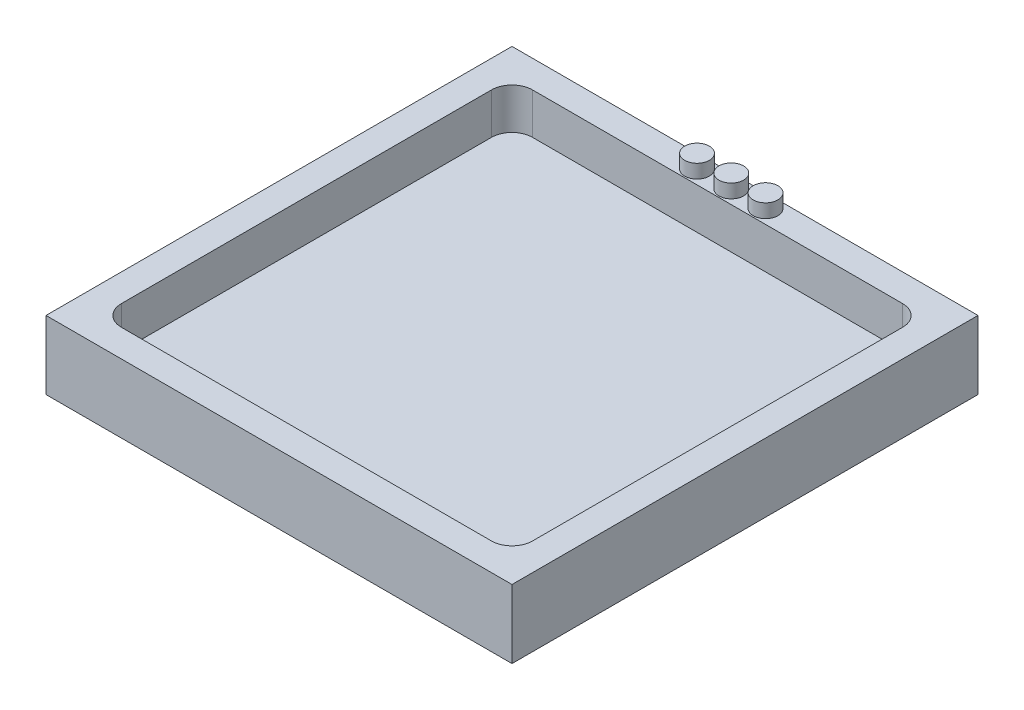
ISO-10303-21;
HEADER;
FILE_DESCRIPTION(('STEP AP214'),'2;1');
FILE_NAME('part.step','',(''),(''),'','','');
FILE_SCHEMA(('AUTOMOTIVE_DESIGN { 1 0 10303 214 1 1 1 1 }'));
ENDSEC;
DATA;
#1=APPLICATION_CONTEXT('core data for automotive mechanical design processes');
#2=APPLICATION_PROTOCOL_DEFINITION('international standard','automotive_design',2000,#1);
#3=PRODUCT_CONTEXT('',#1,'mechanical');
#4=PRODUCT('Part','Part','',(#3));
#5=PRODUCT_RELATED_PRODUCT_CATEGORY('part','',(#4));
#6=PRODUCT_DEFINITION_FORMATION('','',#4);
#7=PRODUCT_DEFINITION_CONTEXT('part definition',#1,'design');
#8=PRODUCT_DEFINITION('design','',#6,#7);
#9=PRODUCT_DEFINITION_SHAPE('','',#8);
#10=(LENGTH_UNIT() NAMED_UNIT(*) SI_UNIT(.MILLI.,.METRE.));
#11=(NAMED_UNIT(*) PLANE_ANGLE_UNIT() SI_UNIT($,.RADIAN.));
#12=(NAMED_UNIT(*) SI_UNIT($,.STERADIAN.) SOLID_ANGLE_UNIT());
#13=UNCERTAINTY_MEASURE_WITH_UNIT(LENGTH_MEASURE(1.E-05),#10,'distance_accuracy_value','');
#14=(GEOMETRIC_REPRESENTATION_CONTEXT(3) GLOBAL_UNCERTAINTY_ASSIGNED_CONTEXT((#13)) GLOBAL_UNIT_ASSIGNED_CONTEXT((#10,
#11,#12)) REPRESENTATION_CONTEXT('',''));
#15=CARTESIAN_POINT('',(0.,0.,0.));
#16=DIRECTION('',(0.,0.,1.));
#17=DIRECTION('',(1.,0.,0.));
#18=AXIS2_PLACEMENT_3D('',#15,#16,#17);
#19=CARTESIAN_POINT('',(0.,2.,0.));
#20=DIRECTION('',(0.,-1.,0.));
#21=DIRECTION('',(0.,0.,-1.));
#22=AXIS2_PLACEMENT_3D('',#19,#20,#21);
#23=PLANE('',#22);
#24=DIRECTION('',(1.,0.,0.));
#25=VECTOR('',#24,1.);
#26=CARTESIAN_POINT('',(-15.,2.,15.));
#27=LINE('',#26,#25);
#28=CARTESIAN_POINT('',(-13.5,2.,15.));
#29=VERTEX_POINT('',#28);
#30=CARTESIAN_POINT('',(13.5,2.,15.));
#31=VERTEX_POINT('',#30);
#32=EDGE_CURVE('E168',#29,#31,#27,.T.);
#33=ORIENTED_EDGE('',*,*,#32,.T.);
#34=CARTESIAN_POINT('',(13.5,2.,13.5));
#35=DIRECTION('',(0.,-1.,0.));
#36=DIRECTION('',(0.,0.,-1.));
#37=AXIS2_PLACEMENT_3D('',#34,#35,#36);
#38=CIRCLE('',#37,1.5);
#39=CARTESIAN_POINT('',(15.,2.,13.5));
#40=VERTEX_POINT('',#39);
#41=EDGE_CURVE('E182',#31,#40,#38,.F.);
#42=ORIENTED_EDGE('',*,*,#41,.T.);
#43=DIRECTION('',(0.,0.,-1.));
#44=VECTOR('',#43,1.);
#45=CARTESIAN_POINT('',(15.,2.,15.));
#46=LINE('',#45,#44);
#47=CARTESIAN_POINT('',(15.,2.,-13.5));
#48=VERTEX_POINT('',#47);
#49=EDGE_CURVE('E165',#40,#48,#46,.T.);
#50=ORIENTED_EDGE('',*,*,#49,.T.);
#51=CARTESIAN_POINT('',(13.5,2.,-13.5));
#52=DIRECTION('',(0.,-1.,0.));
#53=DIRECTION('',(0.,0.,-1.));
#54=AXIS2_PLACEMENT_3D('',#51,#52,#53);
#55=CIRCLE('',#54,1.5);
#56=CARTESIAN_POINT('',(13.5,2.,-15.));
#57=VERTEX_POINT('',#56);
#58=EDGE_CURVE('E176',#48,#57,#55,.F.);
#59=ORIENTED_EDGE('',*,*,#58,.T.);
#60=DIRECTION('',(1.,0.,0.));
#61=VECTOR('',#60,1.);
#62=CARTESIAN_POINT('',(-15.,2.,-15.));
#63=LINE('',#62,#61);
#64=CARTESIAN_POINT('',(-13.5,2.,-15.));
#65=VERTEX_POINT('',#64);
#66=EDGE_CURVE('E157',#65,#57,#63,.T.);
#67=ORIENTED_EDGE('',*,*,#66,.F.);
#68=CARTESIAN_POINT('',(-13.5,2.,-13.5));
#69=DIRECTION('',(0.,-1.,0.));
#70=DIRECTION('',(0.,0.,-1.));
#71=AXIS2_PLACEMENT_3D('',#68,#69,#70);
#72=CIRCLE('',#71,1.5);
#73=CARTESIAN_POINT('',(-15.,2.,-13.5));
#74=VERTEX_POINT('',#73);
#75=EDGE_CURVE('E180',#65,#74,#72,.F.);
#76=ORIENTED_EDGE('',*,*,#75,.T.);
#77=DIRECTION('',(0.,0.,-1.));
#78=VECTOR('',#77,1.);
#79=CARTESIAN_POINT('',(-15.,2.,15.));
#80=LINE('',#79,#78);
#81=CARTESIAN_POINT('',(-15.,2.,13.5));
#82=VERTEX_POINT('',#81);
#83=EDGE_CURVE('E155',#82,#74,#80,.T.);
#84=ORIENTED_EDGE('',*,*,#83,.F.);
#85=CARTESIAN_POINT('',(-13.5,2.,13.5));
#86=DIRECTION('',(0.,-1.,0.));
#87=DIRECTION('',(0.,0.,-1.));
#88=AXIS2_PLACEMENT_3D('',#85,#86,#87);
#89=CIRCLE('',#88,1.5);
#90=EDGE_CURVE('E178',#82,#29,#89,.F.);
#91=ORIENTED_EDGE('',*,*,#90,.T.);
#92=EDGE_LOOP('',(#33,#42,#50,#59,#67,#76,#84,#91));
#93=FACE_BOUND('',#92,.T.);
#94=ADVANCED_FACE('F39',(#93),#23,.F.);
#95=CARTESIAN_POINT('',(15.,5.,15.));
#96=DIRECTION('',(-1.,0.,0.));
#97=DIRECTION('',(0.,0.,1.));
#98=AXIS2_PLACEMENT_3D('',#95,#96,#97);
#99=PLANE('',#98);
#100=ORIENTED_EDGE('',*,*,#49,.F.);
#101=DIRECTION('',(0.,-1.,0.));
#102=VECTOR('',#101,1.);
#103=CARTESIAN_POINT('',(15.,5.,13.5));
#104=LINE('',#103,#102);
#105=CARTESIAN_POINT('',(15.,5.,13.5));
#106=VERTEX_POINT('',#105);
#107=EDGE_CURVE('E187',#40,#106,#104,.F.);
#108=ORIENTED_EDGE('',*,*,#107,.T.);
#109=DIRECTION('',(0.,0.,-1.));
#110=VECTOR('',#109,1.);
#111=CARTESIAN_POINT('',(15.,5.,15.));
#112=LINE('',#111,#110);
#113=CARTESIAN_POINT('',(15.,5.,-13.5));
#114=VERTEX_POINT('',#113);
#115=EDGE_CURVE('E278',#106,#114,#112,.T.);
#116=ORIENTED_EDGE('',*,*,#115,.T.);
#117=DIRECTION('',(0.,-1.,0.));
#118=VECTOR('',#117,1.);
#119=CARTESIAN_POINT('',(15.,2.,-13.5));
#120=LINE('',#119,#118);
#121=EDGE_CURVE('E184',#114,#48,#120,.T.);
#122=ORIENTED_EDGE('',*,*,#121,.T.);
#123=EDGE_LOOP('',(#100,#108,#116,#122));
#124=FACE_BOUND('',#123,.T.);
#125=ADVANCED_FACE('F235',(#124),#99,.T.);
#126=CARTESIAN_POINT('',(-15.,5.,-15.));
#127=DIRECTION('',(0.,0.,1.));
#128=DIRECTION('',(1.,0.,0.));
#129=AXIS2_PLACEMENT_3D('',#126,#127,#128);
#130=PLANE('',#129);
#131=DIRECTION('',(-1.,0.,0.));
#132=VECTOR('',#131,1.);
#133=CARTESIAN_POINT('',(-15.,5.,-15.));
#134=LINE('',#133,#132);
#135=CARTESIAN_POINT('',(13.5,5.,-15.));
#136=VERTEX_POINT('',#135);
#137=CARTESIAN_POINT('',(-13.5,5.,-15.));
#138=VERTEX_POINT('',#137);
#139=EDGE_CURVE('E276',#136,#138,#134,.T.);
#140=ORIENTED_EDGE('',*,*,#139,.T.);
#141=DIRECTION('',(0.,-1.,0.));
#142=VECTOR('',#141,1.);
#143=CARTESIAN_POINT('',(-13.5,2.,-15.));
#144=LINE('',#143,#142);
#145=EDGE_CURVE('E191',#138,#65,#144,.T.);
#146=ORIENTED_EDGE('',*,*,#145,.T.);
#147=ORIENTED_EDGE('',*,*,#66,.T.);
#148=DIRECTION('',(0.,-1.,0.));
#149=VECTOR('',#148,1.);
#150=CARTESIAN_POINT('',(13.5,5.,-15.));
#151=LINE('',#150,#149);
#152=EDGE_CURVE('E189',#57,#136,#151,.F.);
#153=ORIENTED_EDGE('',*,*,#152,.T.);
#154=EDGE_LOOP('',(#140,#146,#147,#153));
#155=FACE_BOUND('',#154,.T.);
#156=ADVANCED_FACE('F242',(#155),#130,.T.);
#157=CARTESIAN_POINT('',(-15.,5.,15.));
#158=DIRECTION('',(1.,0.,0.));
#159=DIRECTION('',(0.,0.,-1.));
#160=AXIS2_PLACEMENT_3D('',#157,#158,#159);
#161=PLANE('',#160);
#162=ORIENTED_EDGE('',*,*,#83,.T.);
#163=DIRECTION('',(0.,-1.,0.));
#164=VECTOR('',#163,1.);
#165=CARTESIAN_POINT('',(-15.,5.,-13.5));
#166=LINE('',#165,#164);
#167=CARTESIAN_POINT('',(-15.,5.,-13.5));
#168=VERTEX_POINT('',#167);
#169=EDGE_CURVE('E61',#74,#168,#166,.F.);
#170=ORIENTED_EDGE('',*,*,#169,.T.);
#171=DIRECTION('',(0.,0.,1.));
#172=VECTOR('',#171,1.);
#173=CARTESIAN_POINT('',(-15.,5.,15.));
#174=LINE('',#173,#172);
#175=CARTESIAN_POINT('',(-15.,5.,13.5));
#176=VERTEX_POINT('',#175);
#177=EDGE_CURVE('E267',#168,#176,#174,.T.);
#178=ORIENTED_EDGE('',*,*,#177,.T.);
#179=DIRECTION('',(0.,-1.,0.));
#180=VECTOR('',#179,1.);
#181=CARTESIAN_POINT('',(-15.,2.,13.5));
#182=LINE('',#181,#180);
#183=EDGE_CURVE('E194',#176,#82,#182,.T.);
#184=ORIENTED_EDGE('',*,*,#183,.T.);
#185=EDGE_LOOP('',(#162,#170,#178,#184));
#186=FACE_BOUND('',#185,.T.);
#187=ADVANCED_FACE('F266',(#186),#161,.T.);
#188=CARTESIAN_POINT('',(-15.,5.,15.));
#189=DIRECTION('',(0.,0.,-1.));
#190=DIRECTION('',(-1.,0.,0.));
#191=AXIS2_PLACEMENT_3D('',#188,#189,#190);
#192=PLANE('',#191);
#193=DIRECTION('',(1.,0.,0.));
#194=VECTOR('',#193,1.);
#195=CARTESIAN_POINT('',(-15.,5.,15.));
#196=LINE('',#195,#194);
#197=CARTESIAN_POINT('',(-13.5,5.,15.));
#198=VERTEX_POINT('',#197);
#199=CARTESIAN_POINT('',(13.5,5.,15.));
#200=VERTEX_POINT('',#199);
#201=EDGE_CURVE('E280',#198,#200,#196,.T.);
#202=ORIENTED_EDGE('',*,*,#201,.T.);
#203=DIRECTION('',(0.,-1.,0.));
#204=VECTOR('',#203,1.);
#205=CARTESIAN_POINT('',(13.5,2.,15.));
#206=LINE('',#205,#204);
#207=EDGE_CURVE('E173',#200,#31,#206,.T.);
#208=ORIENTED_EDGE('',*,*,#207,.T.);
#209=ORIENTED_EDGE('',*,*,#32,.F.);
#210=DIRECTION('',(0.,-1.,0.));
#211=VECTOR('',#210,1.);
#212=CARTESIAN_POINT('',(-13.5,5.,15.));
#213=LINE('',#212,#211);
#214=EDGE_CURVE('E171',#29,#198,#213,.F.);
#215=ORIENTED_EDGE('',*,*,#214,.T.);
#216=EDGE_LOOP('',(#202,#208,#209,#215));
#217=FACE_BOUND('',#216,.T.);
#218=ADVANCED_FACE('F214',(#217),#192,.T.);
#219=CARTESIAN_POINT('',(0.,5.,0.));
#220=DIRECTION('',(0.,-1.,0.));
#221=DIRECTION('',(0.,0.,-1.));
#222=AXIS2_PLACEMENT_3D('',#219,#220,#221);
#223=PLANE('',#222);
#224=CARTESIAN_POINT('',(-2.5,5.,-16.));
#225=DIRECTION('',(0.,-1.,0.));
#226=DIRECTION('',(0.,0.,-1.));
#227=AXIS2_PLACEMENT_3D('',#224,#225,#226);
#228=CIRCLE('',#227,0.900000000000001);
#229=CARTESIAN_POINT('',(-2.5,5.,-16.9));
#230=VERTEX_POINT('',#229);
#231=EDGE_CURVE('E11',#230,#230,#228,.F.);
#232=ORIENTED_EDGE('',*,*,#231,.F.);
#233=EDGE_LOOP('',(#232));
#234=FACE_BOUND('',#233,.T.);
#235=CARTESIAN_POINT('',(0.,5.,-16.));
#236=DIRECTION('',(0.,-1.,0.));
#237=DIRECTION('',(0.,0.,-1.));
#238=AXIS2_PLACEMENT_3D('',#235,#236,#237);
#239=CIRCLE('',#238,0.9);
#240=CARTESIAN_POINT('',(0.,5.,-16.9));
#241=VERTEX_POINT('',#240);
#242=EDGE_CURVE('E47',#241,#241,#239,.F.);
#243=ORIENTED_EDGE('',*,*,#242,.F.);
#244=EDGE_LOOP('',(#243));
#245=FACE_BOUND('',#244,.T.);
#246=CARTESIAN_POINT('',(2.5,5.,-16.));
#247=DIRECTION('',(0.,-1.,0.));
#248=DIRECTION('',(0.,0.,-1.));
#249=AXIS2_PLACEMENT_3D('',#246,#247,#248);
#250=CIRCLE('',#249,0.900000000000001);
#251=CARTESIAN_POINT('',(2.5,5.,-16.9));
#252=VERTEX_POINT('',#251);
#253=EDGE_CURVE('E205',#252,#252,#250,.F.);
#254=ORIENTED_EDGE('',*,*,#253,.F.);
#255=EDGE_LOOP('',(#254));
#256=FACE_BOUND('',#255,.T.);
#257=DIRECTION('',(0.,0.,-1.));
#258=VECTOR('',#257,1.);
#259=CARTESIAN_POINT('',(17.,5.,17.));
#260=LINE('',#259,#258);
#261=CARTESIAN_POINT('',(17.,5.,17.));
#262=VERTEX_POINT('',#261);
#263=CARTESIAN_POINT('',(17.,5.,-17.));
#264=VERTEX_POINT('',#263);
#265=EDGE_CURVE('E141',#262,#264,#260,.T.);
#266=ORIENTED_EDGE('',*,*,#265,.T.);
#267=DIRECTION('',(-1.,0.,0.));
#268=VECTOR('',#267,1.);
#269=CARTESIAN_POINT('',(-17.,5.,-17.));
#270=LINE('',#269,#268);
#271=CARTESIAN_POINT('',(-17.,5.,-17.));
#272=VERTEX_POINT('',#271);
#273=EDGE_CURVE('E130',#264,#272,#270,.T.);
#274=ORIENTED_EDGE('',*,*,#273,.T.);
#275=DIRECTION('',(0.,0.,1.));
#276=VECTOR('',#275,1.);
#277=CARTESIAN_POINT('',(-17.,5.,17.));
#278=LINE('',#277,#276);
#279=CARTESIAN_POINT('',(-17.,5.,17.));
#280=VERTEX_POINT('',#279);
#281=EDGE_CURVE('E140',#272,#280,#278,.T.);
#282=ORIENTED_EDGE('',*,*,#281,.T.);
#283=DIRECTION('',(1.,0.,0.));
#284=VECTOR('',#283,1.);
#285=CARTESIAN_POINT('',(-17.,5.,17.));
#286=LINE('',#285,#284);
#287=EDGE_CURVE('E146',#280,#262,#286,.T.);
#288=ORIENTED_EDGE('',*,*,#287,.T.);
#289=EDGE_LOOP('',(#266,#274,#282,#288));
#290=FACE_BOUND('',#289,.T.);
#291=ORIENTED_EDGE('',*,*,#115,.F.);
#292=CARTESIAN_POINT('',(13.5,5.,13.5));
#293=DIRECTION('',(0.,-1.,0.));
#294=DIRECTION('',(0.,0.,-1.));
#295=AXIS2_PLACEMENT_3D('',#292,#293,#294);
#296=CIRCLE('',#295,1.5);
#297=EDGE_CURVE('E198',#106,#200,#296,.T.);
#298=ORIENTED_EDGE('',*,*,#297,.T.);
#299=ORIENTED_EDGE('',*,*,#201,.F.);
#300=CARTESIAN_POINT('',(-13.5,5.,13.5));
#301=DIRECTION('',(0.,-1.,0.));
#302=DIRECTION('',(0.,0.,-1.));
#303=AXIS2_PLACEMENT_3D('',#300,#301,#302);
#304=CIRCLE('',#303,1.5);
#305=EDGE_CURVE('E54',#198,#176,#304,.T.);
#306=ORIENTED_EDGE('',*,*,#305,.T.);
#307=ORIENTED_EDGE('',*,*,#177,.F.);
#308=CARTESIAN_POINT('',(-13.5,5.,-13.5));
#309=DIRECTION('',(0.,-1.,0.));
#310=DIRECTION('',(0.,0.,-1.));
#311=AXIS2_PLACEMENT_3D('',#308,#309,#310);
#312=CIRCLE('',#311,1.5);
#313=EDGE_CURVE('E200',#168,#138,#312,.T.);
#314=ORIENTED_EDGE('',*,*,#313,.T.);
#315=ORIENTED_EDGE('',*,*,#139,.F.);
#316=CARTESIAN_POINT('',(13.5,5.,-13.5));
#317=DIRECTION('',(0.,-1.,0.));
#318=DIRECTION('',(0.,0.,-1.));
#319=AXIS2_PLACEMENT_3D('',#316,#317,#318);
#320=CIRCLE('',#319,1.5);
#321=EDGE_CURVE('E203',#136,#114,#320,.T.);
#322=ORIENTED_EDGE('',*,*,#321,.T.);
#323=EDGE_LOOP('',(#291,#298,#299,#306,#307,#314,#315,#322));
#324=FACE_BOUND('',#323,.T.);
#325=ADVANCED_FACE('F144',(#234,#245,#256,#290,#324),#223,.F.);
#326=CARTESIAN_POINT('',(17.,5.,17.));
#327=DIRECTION('',(-1.,0.,0.));
#328=DIRECTION('',(0.,0.,1.));
#329=AXIS2_PLACEMENT_3D('',#326,#327,#328);
#330=PLANE('',#329);
#331=DIRECTION('',(0.,0.,-1.));
#332=VECTOR('',#331,1.);
#333=CARTESIAN_POINT('',(17.,0.,17.));
#334=LINE('',#333,#332);
#335=CARTESIAN_POINT('',(17.,0.,17.));
#336=VERTEX_POINT('',#335);
#337=CARTESIAN_POINT('',(17.,0.,-17.));
#338=VERTEX_POINT('',#337);
#339=EDGE_CURVE('E154',#336,#338,#334,.T.);
#340=ORIENTED_EDGE('',*,*,#339,.T.);
#341=DIRECTION('',(0.,-1.,0.));
#342=VECTOR('',#341,1.);
#343=CARTESIAN_POINT('',(17.,5.,-17.));
#344=LINE('',#343,#342);
#345=EDGE_CURVE('E134',#264,#338,#344,.T.);
#346=ORIENTED_EDGE('',*,*,#345,.F.);
#347=ORIENTED_EDGE('',*,*,#265,.F.);
#348=DIRECTION('',(0.,-1.,0.));
#349=VECTOR('',#348,1.);
#350=CARTESIAN_POINT('',(17.,5.,17.));
#351=LINE('',#350,#349);
#352=EDGE_CURVE('E291',#262,#336,#351,.T.);
#353=ORIENTED_EDGE('',*,*,#352,.T.);
#354=EDGE_LOOP('',(#340,#346,#347,#353));
#355=FACE_BOUND('',#354,.T.);
#356=ADVANCED_FACE('F152',(#355),#330,.F.);
#357=CARTESIAN_POINT('',(-17.,5.,-17.));
#358=DIRECTION('',(0.,0.,1.));
#359=DIRECTION('',(1.,0.,0.));
#360=AXIS2_PLACEMENT_3D('',#357,#358,#359);
#361=PLANE('',#360);
#362=DIRECTION('',(-1.,0.,0.));
#363=VECTOR('',#362,1.);
#364=CARTESIAN_POINT('',(-17.,0.,-17.));
#365=LINE('',#364,#363);
#366=CARTESIAN_POINT('',(-17.,0.,-17.));
#367=VERTEX_POINT('',#366);
#368=EDGE_CURVE('E293',#338,#367,#365,.T.);
#369=ORIENTED_EDGE('',*,*,#368,.T.);
#370=DIRECTION('',(0.,-1.,0.));
#371=VECTOR('',#370,1.);
#372=CARTESIAN_POINT('',(-17.,5.,-17.));
#373=LINE('',#372,#371);
#374=EDGE_CURVE('E137',#272,#367,#373,.T.);
#375=ORIENTED_EDGE('',*,*,#374,.F.);
#376=ORIENTED_EDGE('',*,*,#273,.F.);
#377=ORIENTED_EDGE('',*,*,#345,.T.);
#378=EDGE_LOOP('',(#369,#375,#376,#377));
#379=FACE_BOUND('',#378,.T.);
#380=ADVANCED_FACE('F132',(#379),#361,.F.);
#381=CARTESIAN_POINT('',(-17.,5.,17.));
#382=DIRECTION('',(1.,0.,0.));
#383=DIRECTION('',(0.,0.,-1.));
#384=AXIS2_PLACEMENT_3D('',#381,#382,#383);
#385=PLANE('',#384);
#386=DIRECTION('',(0.,0.,1.));
#387=VECTOR('',#386,1.);
#388=CARTESIAN_POINT('',(-17.,0.,17.));
#389=LINE('',#388,#387);
#390=CARTESIAN_POINT('',(-17.,0.,17.));
#391=VERTEX_POINT('',#390);
#392=EDGE_CURVE('E295',#367,#391,#389,.T.);
#393=ORIENTED_EDGE('',*,*,#392,.T.);
#394=DIRECTION('',(0.,-1.,0.));
#395=VECTOR('',#394,1.);
#396=CARTESIAN_POINT('',(-17.,5.,17.));
#397=LINE('',#396,#395);
#398=EDGE_CURVE('E159',#280,#391,#397,.T.);
#399=ORIENTED_EDGE('',*,*,#398,.F.);
#400=ORIENTED_EDGE('',*,*,#281,.F.);
#401=ORIENTED_EDGE('',*,*,#374,.T.);
#402=EDGE_LOOP('',(#393,#399,#400,#401));
#403=FACE_BOUND('',#402,.T.);
#404=ADVANCED_FACE('F304',(#403),#385,.F.);
#405=CARTESIAN_POINT('',(-17.,5.,17.));
#406=DIRECTION('',(0.,0.,-1.));
#407=DIRECTION('',(-1.,0.,0.));
#408=AXIS2_PLACEMENT_3D('',#405,#406,#407);
#409=PLANE('',#408);
#410=DIRECTION('',(1.,0.,0.));
#411=VECTOR('',#410,1.);
#412=CARTESIAN_POINT('',(-17.,0.,17.));
#413=LINE('',#412,#411);
#414=EDGE_CURVE('E150',#391,#336,#413,.T.);
#415=ORIENTED_EDGE('',*,*,#414,.T.);
#416=ORIENTED_EDGE('',*,*,#352,.F.);
#417=ORIENTED_EDGE('',*,*,#287,.F.);
#418=ORIENTED_EDGE('',*,*,#398,.T.);
#419=EDGE_LOOP('',(#415,#416,#417,#418));
#420=FACE_BOUND('',#419,.T.);
#421=ADVANCED_FACE('F251',(#420),#409,.F.);
#422=CARTESIAN_POINT('',(0.,0.,0.));
#423=DIRECTION('',(0.,-1.,0.));
#424=DIRECTION('',(0.,0.,-1.));
#425=AXIS2_PLACEMENT_3D('',#422,#423,#424);
#426=PLANE('',#425);
#427=ORIENTED_EDGE('',*,*,#339,.F.);
#428=ORIENTED_EDGE('',*,*,#414,.F.);
#429=ORIENTED_EDGE('',*,*,#392,.F.);
#430=ORIENTED_EDGE('',*,*,#368,.F.);
#431=EDGE_LOOP('',(#427,#428,#429,#430));
#432=FACE_BOUND('',#431,.T.);
#433=ADVANCED_FACE('F248',(#432),#426,.T.);
#434=CARTESIAN_POINT('',(13.5,5.,13.5));
#435=DIRECTION('',(0.,1.,0.));
#436=DIRECTION('',(0.,0.,1.));
#437=AXIS2_PLACEMENT_3D('',#434,#435,#436);
#438=CYLINDRICAL_SURFACE('',#437,1.5);
#439=ORIENTED_EDGE('',*,*,#297,.F.);
#440=ORIENTED_EDGE('',*,*,#107,.F.);
#441=ORIENTED_EDGE('',*,*,#41,.F.);
#442=ORIENTED_EDGE('',*,*,#207,.F.);
#443=EDGE_LOOP('',(#439,#440,#441,#442));
#444=FACE_BOUND('',#443,.T.);
#445=ADVANCED_FACE('F250',(#444),#438,.F.);
#446=CARTESIAN_POINT('',(-13.5,5.,-13.5));
#447=DIRECTION('',(0.,1.,0.));
#448=DIRECTION('',(0.,0.,1.));
#449=AXIS2_PLACEMENT_3D('',#446,#447,#448);
#450=CYLINDRICAL_SURFACE('',#449,1.5);
#451=ORIENTED_EDGE('',*,*,#313,.F.);
#452=ORIENTED_EDGE('',*,*,#169,.F.);
#453=ORIENTED_EDGE('',*,*,#75,.F.);
#454=ORIENTED_EDGE('',*,*,#145,.F.);
#455=EDGE_LOOP('',(#451,#452,#453,#454));
#456=FACE_BOUND('',#455,.T.);
#457=ADVANCED_FACE('F255',(#456),#450,.F.);
#458=CARTESIAN_POINT('',(-13.5,5.,13.5));
#459=DIRECTION('',(0.,1.,0.));
#460=DIRECTION('',(0.,0.,1.));
#461=AXIS2_PLACEMENT_3D('',#458,#459,#460);
#462=CYLINDRICAL_SURFACE('',#461,1.5);
#463=ORIENTED_EDGE('',*,*,#305,.F.);
#464=ORIENTED_EDGE('',*,*,#214,.F.);
#465=ORIENTED_EDGE('',*,*,#90,.F.);
#466=ORIENTED_EDGE('',*,*,#183,.F.);
#467=EDGE_LOOP('',(#463,#464,#465,#466));
#468=FACE_BOUND('',#467,.T.);
#469=ADVANCED_FACE('F230',(#468),#462,.F.);
#470=CARTESIAN_POINT('',(13.5,5.,-13.5));
#471=DIRECTION('',(0.,1.,0.));
#472=DIRECTION('',(0.,0.,1.));
#473=AXIS2_PLACEMENT_3D('',#470,#471,#472);
#474=CYLINDRICAL_SURFACE('',#473,1.5);
#475=ORIENTED_EDGE('',*,*,#321,.F.);
#476=ORIENTED_EDGE('',*,*,#152,.F.);
#477=ORIENTED_EDGE('',*,*,#58,.F.);
#478=ORIENTED_EDGE('',*,*,#121,.F.);
#479=EDGE_LOOP('',(#475,#476,#477,#478));
#480=FACE_BOUND('',#479,.T.);
#481=ADVANCED_FACE('F41',(#480),#474,.F.);
#482=CARTESIAN_POINT('',(2.5,6.,-16.));
#483=DIRECTION('',(0.,-1.,0.));
#484=DIRECTION('',(0.,0.,-1.));
#485=AXIS2_PLACEMENT_3D('',#482,#483,#484);
#486=CYLINDRICAL_SURFACE('',#485,0.900000000000001);
#487=CARTESIAN_POINT('',(2.5,6.,-16.));
#488=DIRECTION('',(0.,1.,0.));
#489=DIRECTION('',(0.,0.,1.));
#490=AXIS2_PLACEMENT_3D('',#487,#488,#489);
#491=CIRCLE('',#490,0.900000000000001);
#492=CARTESIAN_POINT('',(2.5,6.,-15.1));
#493=VERTEX_POINT('',#492);
#494=EDGE_CURVE('E283',#493,#493,#491,.T.);
#495=ORIENTED_EDGE('',*,*,#494,.F.);
#496=EDGE_LOOP('',(#495));
#497=FACE_BOUND('',#496,.T.);
#498=ORIENTED_EDGE('',*,*,#253,.T.);
#499=EDGE_LOOP('',(#498));
#500=FACE_BOUND('',#499,.T.);
#501=ADVANCED_FACE('F219',(#497,#500),#486,.T.);
#502=CARTESIAN_POINT('',(2.5,6.,-16.));
#503=DIRECTION('',(0.,1.,0.));
#504=DIRECTION('',(0.,0.,1.));
#505=AXIS2_PLACEMENT_3D('',#502,#503,#504);
#506=PLANE('',#505);
#507=ORIENTED_EDGE('',*,*,#494,.T.);
#508=EDGE_LOOP('',(#507));
#509=FACE_BOUND('',#508,.T.);
#510=ADVANCED_FACE('F221',(#509),#506,.T.);
#511=CARTESIAN_POINT('',(0.,6.,-16.));
#512=DIRECTION('',(0.,-1.,0.));
#513=DIRECTION('',(0.,0.,-1.));
#514=AXIS2_PLACEMENT_3D('',#511,#512,#513);
#515=CYLINDRICAL_SURFACE('',#514,0.9);
#516=CARTESIAN_POINT('',(0.,6.,-16.));
#517=DIRECTION('',(0.,1.,0.));
#518=DIRECTION('',(0.,0.,1.));
#519=AXIS2_PLACEMENT_3D('',#516,#517,#518);
#520=CIRCLE('',#519,0.9);
#521=CARTESIAN_POINT('',(0.,6.,-15.1));
#522=VERTEX_POINT('',#521);
#523=EDGE_CURVE('E406',#522,#522,#520,.T.);
#524=ORIENTED_EDGE('',*,*,#523,.F.);
#525=EDGE_LOOP('',(#524));
#526=FACE_BOUND('',#525,.T.);
#527=ORIENTED_EDGE('',*,*,#242,.T.);
#528=EDGE_LOOP('',(#527));
#529=FACE_BOUND('',#528,.T.);
#530=ADVANCED_FACE('F210',(#526,#529),#515,.T.);
#531=CARTESIAN_POINT('',(0.,6.,-16.));
#532=DIRECTION('',(0.,1.,0.));
#533=DIRECTION('',(0.,0.,1.));
#534=AXIS2_PLACEMENT_3D('',#531,#532,#533);
#535=PLANE('',#534);
#536=ORIENTED_EDGE('',*,*,#523,.T.);
#537=EDGE_LOOP('',(#536));
#538=FACE_BOUND('',#537,.T.);
#539=ADVANCED_FACE('F370',(#538),#535,.T.);
#540=CARTESIAN_POINT('',(-2.5,6.,-16.));
#541=DIRECTION('',(0.,-1.,0.));
#542=DIRECTION('',(0.,0.,-1.));
#543=AXIS2_PLACEMENT_3D('',#540,#541,#542);
#544=CYLINDRICAL_SURFACE('',#543,0.900000000000001);
#545=CARTESIAN_POINT('',(-2.5,6.,-16.));
#546=DIRECTION('',(0.,1.,0.));
#547=DIRECTION('',(0.,0.,1.));
#548=AXIS2_PLACEMENT_3D('',#545,#546,#547);
#549=CIRCLE('',#548,0.900000000000001);
#550=CARTESIAN_POINT('',(-2.5,6.,-15.1));
#551=VERTEX_POINT('',#550);
#552=EDGE_CURVE('E405',#551,#551,#549,.T.);
#553=ORIENTED_EDGE('',*,*,#552,.F.);
#554=EDGE_LOOP('',(#553));
#555=FACE_BOUND('',#554,.T.);
#556=ORIENTED_EDGE('',*,*,#231,.T.);
#557=EDGE_LOOP('',(#556));
#558=FACE_BOUND('',#557,.T.);
#559=ADVANCED_FACE('F380',(#555,#558),#544,.T.);
#560=CARTESIAN_POINT('',(-2.5,6.,-16.));
#561=DIRECTION('',(0.,1.,0.));
#562=DIRECTION('',(0.,0.,1.));
#563=AXIS2_PLACEMENT_3D('',#560,#561,#562);
#564=PLANE('',#563);
#565=ORIENTED_EDGE('',*,*,#552,.T.);
#566=EDGE_LOOP('',(#565));
#567=FACE_BOUND('',#566,.T.);
#568=ADVANCED_FACE('F390',(#567),#564,.T.);
#569=CLOSED_SHELL('',(#94,#125,#156,#187,#218,#325,#356,#380,#404,#421,#433,#445,#457,#469,#481,
#501,#510,#530,#539,#559,#568));
#570=MANIFOLD_SOLID_BREP('B2',#569);
#571=ADVANCED_BREP_SHAPE_REPRESENTATION('',(#18,#570),#14);
#572=SHAPE_DEFINITION_REPRESENTATION(#9,#571);
ENDSEC;
END-ISO-10303-21;
